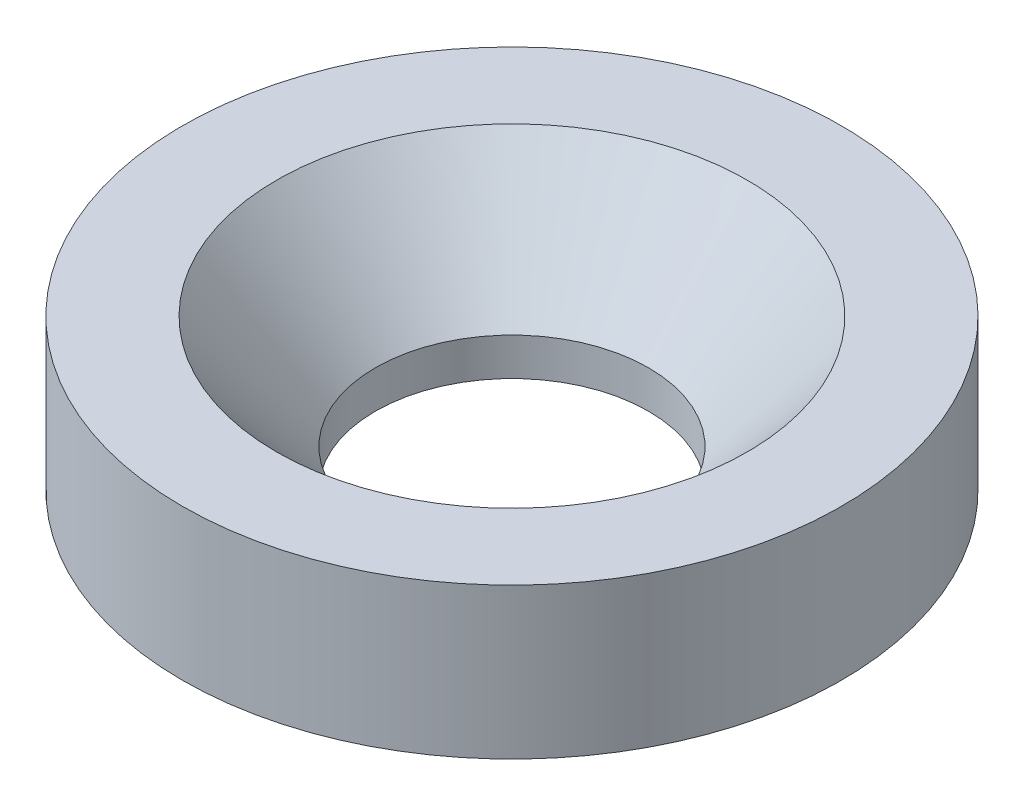
ISO-10303-21;
HEADER;
FILE_DESCRIPTION(('STEP AP214'),'2;1');
FILE_NAME('part.step','',(''),(''),'','','');
FILE_SCHEMA(('AUTOMOTIVE_DESIGN { 1 0 10303 214 1 1 1 1 }'));
ENDSEC;
DATA;
#1=APPLICATION_CONTEXT('core data for automotive mechanical design processes');
#2=APPLICATION_PROTOCOL_DEFINITION('international standard','automotive_design',2000,#1);
#3=PRODUCT_CONTEXT('',#1,'mechanical');
#4=PRODUCT('Part','Part','',(#3));
#5=PRODUCT_RELATED_PRODUCT_CATEGORY('part','',(#4));
#6=PRODUCT_DEFINITION_FORMATION('','',#4);
#7=PRODUCT_DEFINITION_CONTEXT('part definition',#1,'design');
#8=PRODUCT_DEFINITION('design','',#6,#7);
#9=PRODUCT_DEFINITION_SHAPE('','',#8);
#10=(LENGTH_UNIT() NAMED_UNIT(*) SI_UNIT(.MILLI.,.METRE.));
#11=(NAMED_UNIT(*) PLANE_ANGLE_UNIT() SI_UNIT($,.RADIAN.));
#12=(NAMED_UNIT(*) SI_UNIT($,.STERADIAN.) SOLID_ANGLE_UNIT());
#13=UNCERTAINTY_MEASURE_WITH_UNIT(LENGTH_MEASURE(1.E-05),#10,'distance_accuracy_value','');
#14=(GEOMETRIC_REPRESENTATION_CONTEXT(3) GLOBAL_UNCERTAINTY_ASSIGNED_CONTEXT((#13)) GLOBAL_UNIT_ASSIGNED_CONTEXT((#10,
#11,#12)) REPRESENTATION_CONTEXT('',''));
#15=CARTESIAN_POINT('',(0.,0.,0.));
#16=DIRECTION('',(0.,0.,1.));
#17=DIRECTION('',(1.,0.,0.));
#18=AXIS2_PLACEMENT_3D('',#15,#16,#17);
#19=CARTESIAN_POINT('',(0.,54.4429770136498,0.));
#20=DIRECTION('',(0.,1.,0.));
#21=DIRECTION('',(0.,0.,1.));
#22=AXIS2_PLACEMENT_3D('',#19,#20,#21);
#23=CYLINDRICAL_SURFACE('',#22,17.5);
#24=CARTESIAN_POINT('',(0.,-57.1248269340494,0.));
#25=DIRECTION('',(0.,1.,0.));
#26=DIRECTION('',(0.,0.,1.));
#27=AXIS2_PLACEMENT_3D('',#24,#25,#26);
#28=CIRCLE('',#27,17.5);
#29=CARTESIAN_POINT('',(0.,-57.1248269340494,17.5));
#30=VERTEX_POINT('',#29);
#31=EDGE_CURVE('E49',#30,#30,#28,.T.);
#32=ORIENTED_EDGE('',*,*,#31,.F.);
#33=EDGE_LOOP('',(#32));
#34=FACE_BOUND('',#33,.T.);
#35=CARTESIAN_POINT('',(0.,-65.1248269340494,0.));
#36=DIRECTION('',(0.,1.,0.));
#37=DIRECTION('',(0.,0.,1.));
#38=AXIS2_PLACEMENT_3D('',#35,#36,#37);
#39=CIRCLE('',#38,17.5);
#40=CARTESIAN_POINT('',(0.,-65.1248269340494,17.5));
#41=VERTEX_POINT('',#40);
#42=EDGE_CURVE('E10',#41,#41,#39,.T.);
#43=ORIENTED_EDGE('',*,*,#42,.T.);
#44=EDGE_LOOP('',(#43));
#45=FACE_BOUND('',#44,.T.);
#46=ADVANCED_FACE('F30',(#34,#45),#23,.T.);
#47=CARTESIAN_POINT('',(7.25000000001082,-65.1248269340494,0.));
#48=DIRECTION('',(0.,1.,0.));
#49=DIRECTION('',(0.,0.,1.));
#50=AXIS2_PLACEMENT_3D('',#47,#48,#49);
#51=PLANE('',#50);
#52=ORIENTED_EDGE('',*,*,#42,.F.);
#53=EDGE_LOOP('',(#52));
#54=FACE_BOUND('',#53,.T.);
#55=CARTESIAN_POINT('',(0.,-65.1248269340494,0.));
#56=DIRECTION('',(0.,1.,0.));
#57=DIRECTION('',(0.,0.,1.));
#58=AXIS2_PLACEMENT_3D('',#55,#56,#57);
#59=CIRCLE('',#58,7.25000000001082);
#60=CARTESIAN_POINT('',(0.,-65.1248269340494,7.25000000001082));
#61=VERTEX_POINT('',#60);
#62=EDGE_CURVE('E36',#61,#61,#59,.T.);
#63=ORIENTED_EDGE('',*,*,#62,.T.);
#64=EDGE_LOOP('',(#63));
#65=FACE_BOUND('',#64,.T.);
#66=ADVANCED_FACE('F56',(#54,#65),#51,.F.);
#67=CARTESIAN_POINT('',(0.,54.4429770136498,0.));
#68=DIRECTION('',(0.,1.,0.));
#69=DIRECTION('',(0.,0.,1.));
#70=AXIS2_PLACEMENT_3D('',#67,#68,#69);
#71=CYLINDRICAL_SURFACE('',#70,7.25000000001082);
#72=ORIENTED_EDGE('',*,*,#62,.F.);
#73=EDGE_LOOP('',(#72));
#74=FACE_BOUND('',#73,.T.);
#75=CARTESIAN_POINT('',(0.,-63.1248269340494,0.));
#76=DIRECTION('',(0.,1.,0.));
#77=DIRECTION('',(0.,0.,1.));
#78=AXIS2_PLACEMENT_3D('',#75,#76,#77);
#79=CIRCLE('',#78,7.25000000001082);
#80=CARTESIAN_POINT('',(0.,-63.1248269340494,7.25000000001082));
#81=VERTEX_POINT('',#80);
#82=EDGE_CURVE('E40',#81,#81,#79,.T.);
#83=ORIENTED_EDGE('',*,*,#82,.T.);
#84=EDGE_LOOP('',(#83));
#85=FACE_BOUND('',#84,.T.);
#86=ADVANCED_FACE('F60',(#74,#85),#71,.F.);
#87=CARTESIAN_POINT('',(0.,-57.1248269340494,0.));
#88=DIRECTION('',(0.,1.,0.));
#89=DIRECTION('',(0.,0.,1.));
#90=AXIS2_PLACEMENT_3D('',#87,#88,#89);
#91=CONICAL_SURFACE('',#90,12.5,0.718829999620604);
#92=ORIENTED_EDGE('',*,*,#82,.F.);
#93=EDGE_LOOP('',(#92));
#94=FACE_BOUND('',#93,.T.);
#95=CARTESIAN_POINT('',(0.,-57.1248269340494,0.));
#96=DIRECTION('',(0.,1.,0.));
#97=DIRECTION('',(0.,0.,1.));
#98=AXIS2_PLACEMENT_3D('',#95,#96,#97);
#99=CIRCLE('',#98,12.5);
#100=CARTESIAN_POINT('',(0.,-57.1248269340494,12.5));
#101=VERTEX_POINT('',#100);
#102=EDGE_CURVE('E44',#101,#101,#99,.T.);
#103=ORIENTED_EDGE('',*,*,#102,.T.);
#104=EDGE_LOOP('',(#103));
#105=FACE_BOUND('',#104,.T.);
#106=ADVANCED_FACE('F65',(#94,#105),#91,.F.);
#107=CARTESIAN_POINT('',(12.5,-57.1248269340494,0.));
#108=DIRECTION('',(0.,-1.,0.));
#109=DIRECTION('',(0.,0.,-1.));
#110=AXIS2_PLACEMENT_3D('',#107,#108,#109);
#111=PLANE('',#110);
#112=ORIENTED_EDGE('',*,*,#102,.F.);
#113=EDGE_LOOP('',(#112));
#114=FACE_BOUND('',#113,.T.);
#115=ORIENTED_EDGE('',*,*,#31,.T.);
#116=EDGE_LOOP('',(#115));
#117=FACE_BOUND('',#116,.T.);
#118=ADVANCED_FACE('F53',(#114,#117),#111,.F.);
#119=CLOSED_SHELL('',(#46,#66,#86,#106,#118));
#120=MANIFOLD_SOLID_BREP('B2',#119);
#121=ADVANCED_BREP_SHAPE_REPRESENTATION('',(#18,#120),#14);
#122=SHAPE_DEFINITION_REPRESENTATION(#9,#121);
ENDSEC;
END-ISO-10303-21;
